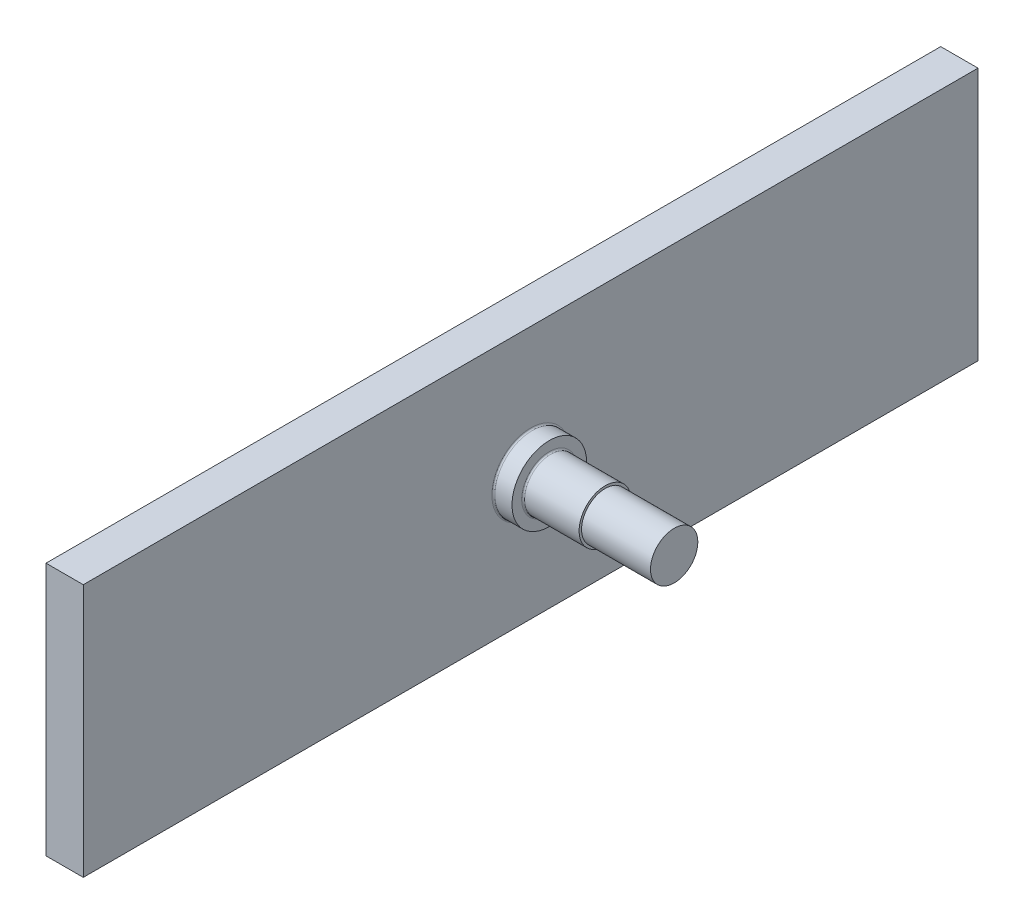
ISO-10303-21;
HEADER;
FILE_DESCRIPTION(('STEP AP214'),'2;1');
FILE_NAME('part.step','',(''),(''),'','','');
FILE_SCHEMA(('AUTOMOTIVE_DESIGN { 1 0 10303 214 1 1 1 1 }'));
ENDSEC;
DATA;
#1=APPLICATION_CONTEXT('core data for automotive mechanical design processes');
#2=APPLICATION_PROTOCOL_DEFINITION('international standard','automotive_design',2000,#1);
#3=PRODUCT_CONTEXT('',#1,'mechanical');
#4=PRODUCT('Part','Part','',(#3));
#5=PRODUCT_RELATED_PRODUCT_CATEGORY('part','',(#4));
#6=PRODUCT_DEFINITION_FORMATION('','',#4);
#7=PRODUCT_DEFINITION_CONTEXT('part definition',#1,'design');
#8=PRODUCT_DEFINITION('design','',#6,#7);
#9=PRODUCT_DEFINITION_SHAPE('','',#8);
#10=(LENGTH_UNIT() NAMED_UNIT(*) SI_UNIT(.MILLI.,.METRE.));
#11=(NAMED_UNIT(*) PLANE_ANGLE_UNIT() SI_UNIT($,.RADIAN.));
#12=(NAMED_UNIT(*) SI_UNIT($,.STERADIAN.) SOLID_ANGLE_UNIT());
#13=UNCERTAINTY_MEASURE_WITH_UNIT(LENGTH_MEASURE(1.E-05),#10,'distance_accuracy_value','');
#14=(GEOMETRIC_REPRESENTATION_CONTEXT(3) GLOBAL_UNCERTAINTY_ASSIGNED_CONTEXT((#13)) GLOBAL_UNIT_ASSIGNED_CONTEXT((#10,
#11,#12)) REPRESENTATION_CONTEXT('',''));
#15=CARTESIAN_POINT('',(0.,0.,0.));
#16=DIRECTION('',(0.,0.,1.));
#17=DIRECTION('',(1.,0.,0.));
#18=AXIS2_PLACEMENT_3D('',#15,#16,#17);
#19=CARTESIAN_POINT('',(24.25,17.,60.));
#20=DIRECTION('',(-1.,0.,0.));
#21=DIRECTION('',(0.,0.,1.));
#22=AXIS2_PLACEMENT_3D('',#19,#20,#21);
#23=CYLINDRICAL_SURFACE('',#22,3.5);
#24=CARTESIAN_POINT('',(7.7,17.,60.));
#25=DIRECTION('',(1.,0.,0.));
#26=DIRECTION('',(0.,0.,-1.));
#27=AXIS2_PLACEMENT_3D('',#24,#25,#26);
#28=CIRCLE('',#27,3.5);
#29=CARTESIAN_POINT('',(7.7,17.,56.5));
#30=VERTEX_POINT('',#29);
#31=EDGE_CURVE('E118',#30,#30,#28,.T.);
#32=ORIENTED_EDGE('',*,*,#31,.T.);
#33=EDGE_LOOP('',(#32));
#34=FACE_BOUND('',#33,.T.);
#35=CARTESIAN_POINT('',(15.,17.,60.));
#36=DIRECTION('',(1.,0.,0.));
#37=DIRECTION('',(0.,0.,-1.));
#38=AXIS2_PLACEMENT_3D('',#35,#36,#37);
#39=CIRCLE('',#38,3.50000000000001);
#40=CARTESIAN_POINT('',(15.,17.,56.5));
#41=VERTEX_POINT('',#40);
#42=EDGE_CURVE('E272',#41,#41,#39,.F.);
#43=ORIENTED_EDGE('',*,*,#42,.T.);
#44=EDGE_LOOP('',(#43));
#45=FACE_BOUND('',#44,.T.);
#46=ADVANCED_FACE('F39',(#34,#45),#23,.T.);
#47=CARTESIAN_POINT('',(5.,0.,120.));
#48=DIRECTION('',(0.,0.,1.));
#49=DIRECTION('',(1.,0.,0.));
#50=AXIS2_PLACEMENT_3D('',#47,#48,#49);
#51=PLANE('',#50);
#52=DIRECTION('',(0.,1.,0.));
#53=VECTOR('',#52,1.);
#54=CARTESIAN_POINT('',(0.,0.,120.));
#55=LINE('',#54,#53);
#56=CARTESIAN_POINT('',(0.,0.,120.));
#57=VERTEX_POINT('',#56);
#58=CARTESIAN_POINT('',(0.,34.,120.));
#59=VERTEX_POINT('',#58);
#60=EDGE_CURVE('E108',#57,#59,#55,.T.);
#61=ORIENTED_EDGE('',*,*,#60,.F.);
#62=DIRECTION('',(-1.,0.,0.));
#63=VECTOR('',#62,1.);
#64=CARTESIAN_POINT('',(5.,0.,120.));
#65=LINE('',#64,#63);
#66=CARTESIAN_POINT('',(5.,0.,120.));
#67=VERTEX_POINT('',#66);
#68=EDGE_CURVE('E83',#67,#57,#65,.T.);
#69=ORIENTED_EDGE('',*,*,#68,.F.);
#70=DIRECTION('',(0.,1.,0.));
#71=VECTOR('',#70,1.);
#72=CARTESIAN_POINT('',(5.,0.,120.));
#73=LINE('',#72,#71);
#74=CARTESIAN_POINT('',(5.,34.,120.));
#75=VERTEX_POINT('',#74);
#76=EDGE_CURVE('E101',#67,#75,#73,.T.);
#77=ORIENTED_EDGE('',*,*,#76,.T.);
#78=DIRECTION('',(-1.,0.,0.));
#79=VECTOR('',#78,1.);
#80=CARTESIAN_POINT('',(5.,34.,120.));
#81=LINE('',#80,#79);
#82=EDGE_CURVE('E79',#75,#59,#81,.T.);
#83=ORIENTED_EDGE('',*,*,#82,.T.);
#84=EDGE_LOOP('',(#61,#69,#77,#83));
#85=FACE_BOUND('',#84,.T.);
#86=ADVANCED_FACE('F139',(#85),#51,.T.);
#87=CARTESIAN_POINT('',(5.,0.,0.));
#88=DIRECTION('',(0.,-1.,0.));
#89=DIRECTION('',(0.,0.,-1.));
#90=AXIS2_PLACEMENT_3D('',#87,#88,#89);
#91=PLANE('',#90);
#92=DIRECTION('',(0.,0.,1.));
#93=VECTOR('',#92,1.);
#94=CARTESIAN_POINT('',(0.,0.,0.));
#95=LINE('',#94,#93);
#96=CARTESIAN_POINT('',(0.,0.,0.));
#97=VERTEX_POINT('',#96);
#98=EDGE_CURVE('E94',#97,#57,#95,.T.);
#99=ORIENTED_EDGE('',*,*,#98,.F.);
#100=DIRECTION('',(-1.,0.,0.));
#101=VECTOR('',#100,1.);
#102=CARTESIAN_POINT('',(5.,0.,0.));
#103=LINE('',#102,#101);
#104=CARTESIAN_POINT('',(5.,0.,0.));
#105=VERTEX_POINT('',#104);
#106=EDGE_CURVE('E88',#105,#97,#103,.T.);
#107=ORIENTED_EDGE('',*,*,#106,.F.);
#108=DIRECTION('',(0.,0.,1.));
#109=VECTOR('',#108,1.);
#110=CARTESIAN_POINT('',(5.,0.,0.));
#111=LINE('',#110,#109);
#112=EDGE_CURVE('E92',#105,#67,#111,.T.);
#113=ORIENTED_EDGE('',*,*,#112,.T.);
#114=ORIENTED_EDGE('',*,*,#68,.T.);
#115=EDGE_LOOP('',(#99,#107,#113,#114));
#116=FACE_BOUND('',#115,.T.);
#117=ADVANCED_FACE('F90',(#116),#91,.T.);
#118=CARTESIAN_POINT('',(5.,0.,0.));
#119=DIRECTION('',(0.,0.,1.));
#120=DIRECTION('',(0.,-1.,0.));
#121=AXIS2_PLACEMENT_3D('',#118,#119,#120);
#122=PLANE('',#121);
#123=DIRECTION('',(0.,1.,0.));
#124=VECTOR('',#123,1.);
#125=CARTESIAN_POINT('',(0.,0.,0.));
#126=LINE('',#125,#124);
#127=CARTESIAN_POINT('',(0.,34.,0.));
#128=VERTEX_POINT('',#127);
#129=EDGE_CURVE('E72',#97,#128,#126,.T.);
#130=ORIENTED_EDGE('',*,*,#129,.T.);
#131=DIRECTION('',(-1.,0.,0.));
#132=VECTOR('',#131,1.);
#133=CARTESIAN_POINT('',(5.,34.,0.));
#134=LINE('',#133,#132);
#135=CARTESIAN_POINT('',(5.,34.,0.));
#136=VERTEX_POINT('',#135);
#137=EDGE_CURVE('E95',#136,#128,#134,.T.);
#138=ORIENTED_EDGE('',*,*,#137,.F.);
#139=DIRECTION('',(0.,1.,0.));
#140=VECTOR('',#139,1.);
#141=CARTESIAN_POINT('',(5.,0.,0.));
#142=LINE('',#141,#140);
#143=EDGE_CURVE('E97',#105,#136,#142,.T.);
#144=ORIENTED_EDGE('',*,*,#143,.F.);
#145=ORIENTED_EDGE('',*,*,#106,.T.);
#146=EDGE_LOOP('',(#130,#138,#144,#145));
#147=FACE_BOUND('',#146,.T.);
#148=ADVANCED_FACE('F98',(#147),#122,.F.);
#149=CARTESIAN_POINT('',(5.,34.,0.));
#150=DIRECTION('',(0.,-1.,0.));
#151=DIRECTION('',(0.,0.,-1.));
#152=AXIS2_PLACEMENT_3D('',#149,#150,#151);
#153=PLANE('',#152);
#154=DIRECTION('',(0.,0.,1.));
#155=VECTOR('',#154,1.);
#156=CARTESIAN_POINT('',(0.,34.,0.));
#157=LINE('',#156,#155);
#158=EDGE_CURVE('E103',#128,#59,#157,.T.);
#159=ORIENTED_EDGE('',*,*,#158,.T.);
#160=ORIENTED_EDGE('',*,*,#82,.F.);
#161=DIRECTION('',(0.,0.,1.));
#162=VECTOR('',#161,1.);
#163=CARTESIAN_POINT('',(5.,34.,0.));
#164=LINE('',#163,#162);
#165=EDGE_CURVE('E56',#136,#75,#164,.T.);
#166=ORIENTED_EDGE('',*,*,#165,.F.);
#167=ORIENTED_EDGE('',*,*,#137,.T.);
#168=EDGE_LOOP('',(#159,#160,#166,#167));
#169=FACE_BOUND('',#168,.T.);
#170=ADVANCED_FACE('F160',(#169),#153,.F.);
#171=CARTESIAN_POINT('',(5.,0.,0.));
#172=DIRECTION('',(1.,0.,0.));
#173=DIRECTION('',(0.,0.,-1.));
#174=AXIS2_PLACEMENT_3D('',#171,#172,#173);
#175=PLANE('',#174);
#176=CARTESIAN_POINT('',(5.,17.,60.));
#177=DIRECTION('',(1.,0.,0.));
#178=DIRECTION('',(0.,0.,-1.));
#179=AXIS2_PLACEMENT_3D('',#176,#177,#178);
#180=CIRCLE('',#179,5.2);
#181=CARTESIAN_POINT('',(5.,17.,54.8));
#182=VERTEX_POINT('',#181);
#183=EDGE_CURVE('E13',#182,#182,#180,.F.);
#184=ORIENTED_EDGE('',*,*,#183,.T.);
#185=EDGE_LOOP('',(#184));
#186=FACE_BOUND('',#185,.T.);
#187=ORIENTED_EDGE('',*,*,#76,.F.);
#188=ORIENTED_EDGE('',*,*,#112,.F.);
#189=ORIENTED_EDGE('',*,*,#143,.T.);
#190=ORIENTED_EDGE('',*,*,#165,.T.);
#191=EDGE_LOOP('',(#187,#188,#189,#190));
#192=FACE_BOUND('',#191,.T.);
#193=ADVANCED_FACE('F100',(#186,#192),#175,.T.);
#194=CARTESIAN_POINT('',(0.,0.,0.));
#195=DIRECTION('',(1.,0.,0.));
#196=DIRECTION('',(0.,0.,-1.));
#197=AXIS2_PLACEMENT_3D('',#194,#195,#196);
#198=PLANE('',#197);
#199=ORIENTED_EDGE('',*,*,#60,.T.);
#200=ORIENTED_EDGE('',*,*,#158,.F.);
#201=ORIENTED_EDGE('',*,*,#129,.F.);
#202=ORIENTED_EDGE('',*,*,#98,.T.);
#203=EDGE_LOOP('',(#199,#200,#201,#202));
#204=FACE_BOUND('',#203,.T.);
#205=ADVANCED_FACE('F157',(#204),#198,.F.);
#206=CARTESIAN_POINT('',(7.5,17.,60.));
#207=DIRECTION('',(-1.,0.,0.));
#208=DIRECTION('',(0.,0.,1.));
#209=AXIS2_PLACEMENT_3D('',#206,#207,#208);
#210=CYLINDRICAL_SURFACE('',#209,5.);
#211=CARTESIAN_POINT('',(5.2,17.,60.));
#212=DIRECTION('',(1.,0.,0.));
#213=DIRECTION('',(0.,0.,-1.));
#214=AXIS2_PLACEMENT_3D('',#211,#212,#213);
#215=CIRCLE('',#214,5.);
#216=CARTESIAN_POINT('',(5.2,17.,55.));
#217=VERTEX_POINT('',#216);
#218=EDGE_CURVE('E48',#217,#217,#215,.T.);
#219=ORIENTED_EDGE('',*,*,#218,.T.);
#220=EDGE_LOOP('',(#219));
#221=FACE_BOUND('',#220,.T.);
#222=CARTESIAN_POINT('',(7.5,17.,60.));
#223=DIRECTION('',(1.,0.,0.));
#224=DIRECTION('',(0.,0.,-1.));
#225=AXIS2_PLACEMENT_3D('',#222,#223,#224);
#226=CIRCLE('',#225,5.);
#227=CARTESIAN_POINT('',(7.5,17.,55.));
#228=VERTEX_POINT('',#227);
#229=EDGE_CURVE('E111',#228,#228,#226,.T.);
#230=ORIENTED_EDGE('',*,*,#229,.F.);
#231=EDGE_LOOP('',(#230));
#232=FACE_BOUND('',#231,.T.);
#233=ADVANCED_FACE('F126',(#221,#232),#210,.T.);
#234=CARTESIAN_POINT('',(7.5,0.,0.));
#235=DIRECTION('',(1.,0.,0.));
#236=DIRECTION('',(0.,0.,-1.));
#237=AXIS2_PLACEMENT_3D('',#234,#235,#236);
#238=PLANE('',#237);
#239=CARTESIAN_POINT('',(7.5,17.,60.));
#240=DIRECTION('',(1.,0.,0.));
#241=DIRECTION('',(0.,0.,-1.));
#242=AXIS2_PLACEMENT_3D('',#239,#240,#241);
#243=CIRCLE('',#242,3.7);
#244=CARTESIAN_POINT('',(7.5,17.,56.3));
#245=VERTEX_POINT('',#244);
#246=EDGE_CURVE('E121',#245,#245,#243,.F.);
#247=ORIENTED_EDGE('',*,*,#246,.T.);
#248=EDGE_LOOP('',(#247));
#249=FACE_BOUND('',#248,.T.);
#250=ORIENTED_EDGE('',*,*,#229,.T.);
#251=EDGE_LOOP('',(#250));
#252=FACE_BOUND('',#251,.T.);
#253=ADVANCED_FACE('F150',(#249,#252),#238,.T.);
#254=CARTESIAN_POINT('',(-2.39949493661169,17.,60.));
#255=DIRECTION('',(1.,0.,0.));
#256=DIRECTION('',(0.,0.,-1.));
#257=AXIS2_PLACEMENT_3D('',#254,#255,#256);
#258=CYLINDRICAL_SURFACE('',#257,3.175);
#259=CARTESIAN_POINT('',(15.,17.,60.));
#260=DIRECTION('',(1.,0.,0.));
#261=DIRECTION('',(0.,0.,-1.));
#262=AXIS2_PLACEMENT_3D('',#259,#260,#261);
#263=CIRCLE('',#262,3.175);
#264=CARTESIAN_POINT('',(15.,17.,56.825));
#265=VERTEX_POINT('',#264);
#266=EDGE_CURVE('E275',#265,#265,#263,.F.);
#267=ORIENTED_EDGE('',*,*,#266,.F.);
#268=EDGE_LOOP('',(#267));
#269=FACE_BOUND('',#268,.T.);
#270=CARTESIAN_POINT('',(24.25,17.,60.));
#271=DIRECTION('',(1.,0.,0.));
#272=DIRECTION('',(0.,0.,-1.));
#273=AXIS2_PLACEMENT_3D('',#270,#271,#272);
#274=CIRCLE('',#273,3.175);
#275=CARTESIAN_POINT('',(24.25,17.,56.825));
#276=VERTEX_POINT('',#275);
#277=EDGE_CURVE('E270',#276,#276,#274,.T.);
#278=ORIENTED_EDGE('',*,*,#277,.F.);
#279=EDGE_LOOP('',(#278));
#280=FACE_BOUND('',#279,.T.);
#281=ADVANCED_FACE('F153',(#269,#280),#258,.T.);
#282=CARTESIAN_POINT('',(15.,0.,0.));
#283=DIRECTION('',(1.,0.,0.));
#284=DIRECTION('',(0.,0.,-1.));
#285=AXIS2_PLACEMENT_3D('',#282,#283,#284);
#286=PLANE('',#285);
#287=ORIENTED_EDGE('',*,*,#42,.F.);
#288=EDGE_LOOP('',(#287));
#289=FACE_BOUND('',#288,.T.);
#290=ORIENTED_EDGE('',*,*,#266,.T.);
#291=EDGE_LOOP('',(#290));
#292=FACE_BOUND('',#291,.T.);
#293=ADVANCED_FACE('F206',(#289,#292),#286,.T.);
#294=CARTESIAN_POINT('',(24.25,17.,60.));
#295=DIRECTION('',(1.,0.,0.));
#296=DIRECTION('',(0.,0.,-1.));
#297=AXIS2_PLACEMENT_3D('',#294,#295,#296);
#298=PLANE('',#297);
#299=ORIENTED_EDGE('',*,*,#277,.T.);
#300=EDGE_LOOP('',(#299));
#301=FACE_BOUND('',#300,.T.);
#302=ADVANCED_FACE('F135',(#301),#298,.T.);
#303=CARTESIAN_POINT('',(7.7,17.,60.));
#304=DIRECTION('',(1.,0.,0.));
#305=DIRECTION('',(0.,0.,-1.));
#306=AXIS2_PLACEMENT_3D('',#303,#304,#305);
#307=TOROIDAL_SURFACE('',#306,3.7,0.2);
#308=ORIENTED_EDGE('',*,*,#246,.F.);
#309=EDGE_LOOP('',(#308));
#310=FACE_BOUND('',#309,.T.);
#311=ORIENTED_EDGE('',*,*,#31,.F.);
#312=EDGE_LOOP('',(#311));
#313=FACE_BOUND('',#312,.T.);
#314=ADVANCED_FACE('F130',(#310,#313),#307,.F.);
#315=CARTESIAN_POINT('',(5.2,17.,60.));
#316=DIRECTION('',(1.,0.,0.));
#317=DIRECTION('',(0.,0.,-1.));
#318=AXIS2_PLACEMENT_3D('',#315,#316,#317);
#319=TOROIDAL_SURFACE('',#318,5.2,0.2);
#320=ORIENTED_EDGE('',*,*,#183,.F.);
#321=EDGE_LOOP('',(#320));
#322=FACE_BOUND('',#321,.T.);
#323=ORIENTED_EDGE('',*,*,#218,.F.);
#324=EDGE_LOOP('',(#323));
#325=FACE_BOUND('',#324,.T.);
#326=ADVANCED_FACE('F41',(#322,#325),#319,.F.);
#327=CLOSED_SHELL('',(#46,#86,#117,#148,#170,#193,#205,#233,#253,#281,#293,#302,#314,#326));
#328=MANIFOLD_SOLID_BREP('B2',#327);
#329=ADVANCED_BREP_SHAPE_REPRESENTATION('',(#18,#328),#14);
#330=SHAPE_DEFINITION_REPRESENTATION(#9,#329);
ENDSEC;
END-ISO-10303-21;
